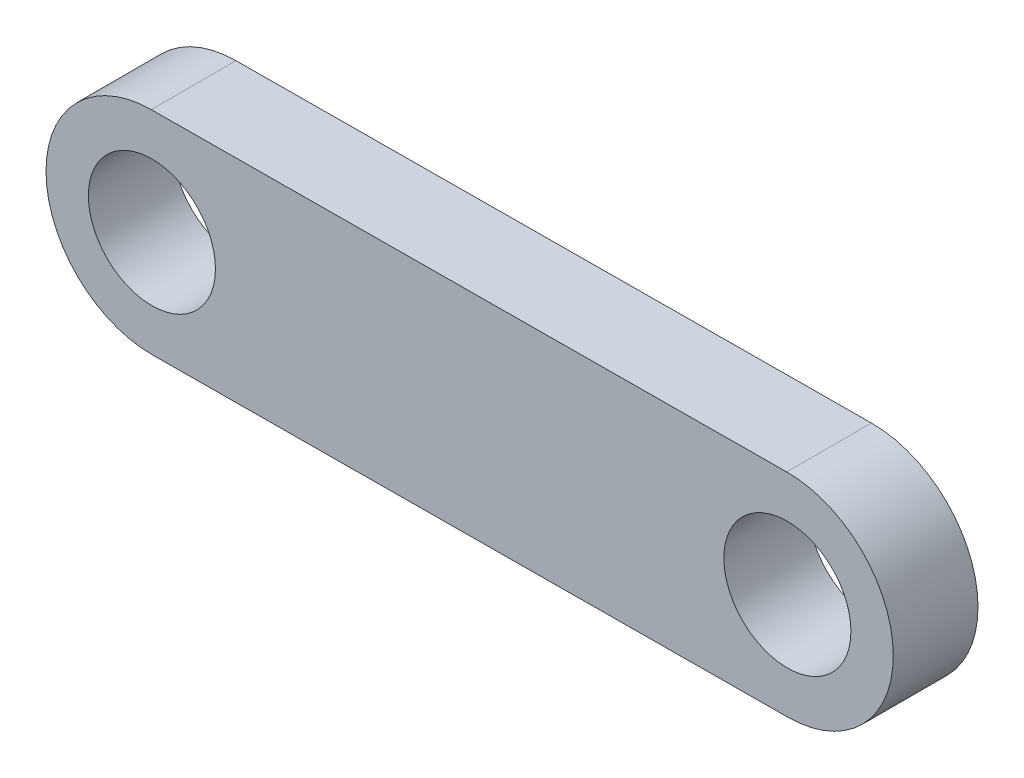
ISO-10303-21;
HEADER;
FILE_DESCRIPTION(('STEP AP214'),'2;1');
FILE_NAME('part.step','',(''),(''),'','','');
FILE_SCHEMA(('AUTOMOTIVE_DESIGN { 1 0 10303 214 1 1 1 1 }'));
ENDSEC;
DATA;
#1=APPLICATION_CONTEXT('core data for automotive mechanical design processes');
#2=APPLICATION_PROTOCOL_DEFINITION('international standard','automotive_design',2000,#1);
#3=PRODUCT_CONTEXT('',#1,'mechanical');
#4=PRODUCT('Part','Part','',(#3));
#5=PRODUCT_RELATED_PRODUCT_CATEGORY('part','',(#4));
#6=PRODUCT_DEFINITION_FORMATION('','',#4);
#7=PRODUCT_DEFINITION_CONTEXT('part definition',#1,'design');
#8=PRODUCT_DEFINITION('design','',#6,#7);
#9=PRODUCT_DEFINITION_SHAPE('','',#8);
#10=(LENGTH_UNIT() NAMED_UNIT(*) SI_UNIT(.MILLI.,.METRE.));
#11=(NAMED_UNIT(*) PLANE_ANGLE_UNIT() SI_UNIT($,.RADIAN.));
#12=(NAMED_UNIT(*) SI_UNIT($,.STERADIAN.) SOLID_ANGLE_UNIT());
#13=UNCERTAINTY_MEASURE_WITH_UNIT(LENGTH_MEASURE(1.E-05),#10,'distance_accuracy_value','');
#14=(GEOMETRIC_REPRESENTATION_CONTEXT(3) GLOBAL_UNCERTAINTY_ASSIGNED_CONTEXT((#13)) GLOBAL_UNIT_ASSIGNED_CONTEXT((#10,
#11,#12)) REPRESENTATION_CONTEXT('',''));
#15=CARTESIAN_POINT('',(0.,0.,0.));
#16=DIRECTION('',(0.,0.,1.));
#17=DIRECTION('',(1.,0.,0.));
#18=AXIS2_PLACEMENT_3D('',#15,#16,#17);
#19=CARTESIAN_POINT('',(0.,0.,2.));
#20=DIRECTION('',(0.,0.,1.));
#21=DIRECTION('',(1.,0.,0.));
#22=AXIS2_PLACEMENT_3D('',#19,#20,#21);
#23=PLANE('',#22);
#24=CARTESIAN_POINT('',(0.,0.,2.));
#25=DIRECTION('',(0.,0.,1.));
#26=DIRECTION('',(1.,0.,0.));
#27=AXIS2_PLACEMENT_3D('',#24,#25,#26);
#28=CIRCLE('',#27,1.5);
#29=CARTESIAN_POINT('',(1.5,0.,2.));
#30=VERTEX_POINT('',#29);
#31=EDGE_CURVE('E103',#30,#30,#28,.T.);
#32=ORIENTED_EDGE('',*,*,#31,.F.);
#33=EDGE_LOOP('',(#32));
#34=FACE_BOUND('',#33,.T.);
#35=CARTESIAN_POINT('',(0.,0.,2.));
#36=DIRECTION('',(0.,0.,1.));
#37=DIRECTION('',(1.,0.,0.));
#38=AXIS2_PLACEMENT_3D('',#35,#36,#37);
#39=CIRCLE('',#38,2.5);
#40=CARTESIAN_POINT('',(-0.015603059271234,2.4999513084341,2.));
#41=VERTEX_POINT('',#40);
#42=CARTESIAN_POINT('',(0.0156030592712317,-2.4999513084341,2.));
#43=VERTEX_POINT('',#42);
#44=EDGE_CURVE('E88',#41,#43,#39,.T.);
#45=ORIENTED_EDGE('',*,*,#44,.T.);
#46=DIRECTION('',(0.999980523373641,0.00624122370849314,0.));
#47=VECTOR('',#46,1.);
#48=CARTESIAN_POINT('',(0.0156030592712317,-2.4999513084341,2.));
#49=LINE('',#48,#47);
#50=CARTESIAN_POINT('',(15.0156030592712,-2.40633112940146,2.));
#51=VERTEX_POINT('',#50);
#52=EDGE_CURVE('E83',#43,#51,#49,.T.);
#53=ORIENTED_EDGE('',*,*,#52,.T.);
#54=CARTESIAN_POINT('',(15.,0.0936201790326438,2.));
#55=DIRECTION('',(0.,0.,1.));
#56=DIRECTION('',(1.,0.,0.));
#57=AXIS2_PLACEMENT_3D('',#54,#55,#56);
#58=CIRCLE('',#57,2.5);
#59=CARTESIAN_POINT('',(14.9843969407288,2.59357148746675,2.));
#60=VERTEX_POINT('',#59);
#61=EDGE_CURVE('E86',#51,#60,#58,.T.);
#62=ORIENTED_EDGE('',*,*,#61,.T.);
#63=DIRECTION('',(-0.999980523373641,-0.00624122370849314,0.));
#64=VECTOR('',#63,1.);
#65=CARTESIAN_POINT('',(-0.015603059271234,2.4999513084341,2.));
#66=LINE('',#65,#64);
#67=EDGE_CURVE('E53',#60,#41,#66,.T.);
#68=ORIENTED_EDGE('',*,*,#67,.T.);
#69=EDGE_LOOP('',(#45,#53,#62,#68));
#70=FACE_BOUND('',#69,.T.);
#71=CARTESIAN_POINT('',(15.,0.0936201790326438,2.));
#72=DIRECTION('',(0.,0.,1.));
#73=DIRECTION('',(1.,0.,0.));
#74=AXIS2_PLACEMENT_3D('',#71,#72,#73);
#75=CIRCLE('',#74,1.5);
#76=CARTESIAN_POINT('',(16.5,0.0936201790326438,2.));
#77=VERTEX_POINT('',#76);
#78=EDGE_CURVE('E118',#77,#77,#75,.T.);
#79=ORIENTED_EDGE('',*,*,#78,.F.);
#80=EDGE_LOOP('',(#79));
#81=FACE_BOUND('',#80,.T.);
#82=ADVANCED_FACE('F36',(#34,#70,#81),#23,.T.);
#83=CARTESIAN_POINT('',(0.,0.,0.));
#84=DIRECTION('',(0.,0.,1.));
#85=DIRECTION('',(1.,0.,0.));
#86=AXIS2_PLACEMENT_3D('',#83,#84,#85);
#87=PLANE('',#86);
#88=CARTESIAN_POINT('',(0.,0.,0.));
#89=DIRECTION('',(0.,0.,1.));
#90=DIRECTION('',(1.,0.,0.));
#91=AXIS2_PLACEMENT_3D('',#88,#89,#90);
#92=CIRCLE('',#91,2.5);
#93=CARTESIAN_POINT('',(-0.015603059271234,2.4999513084341,0.));
#94=VERTEX_POINT('',#93);
#95=CARTESIAN_POINT('',(0.0156030592712317,-2.4999513084341,0.));
#96=VERTEX_POINT('',#95);
#97=EDGE_CURVE('E100',#94,#96,#92,.T.);
#98=ORIENTED_EDGE('',*,*,#97,.F.);
#99=DIRECTION('',(-0.999980523373641,-0.00624122370849314,0.));
#100=VECTOR('',#99,1.);
#101=CARTESIAN_POINT('',(-0.015603059271234,2.4999513084341,0.));
#102=LINE('',#101,#100);
#103=CARTESIAN_POINT('',(14.9843969407288,2.59357148746675,0.));
#104=VERTEX_POINT('',#103);
#105=EDGE_CURVE('E76',#104,#94,#102,.T.);
#106=ORIENTED_EDGE('',*,*,#105,.F.);
#107=CARTESIAN_POINT('',(15.,0.0936201790326438,0.));
#108=DIRECTION('',(0.,0.,1.));
#109=DIRECTION('',(1.,0.,0.));
#110=AXIS2_PLACEMENT_3D('',#107,#108,#109);
#111=CIRCLE('',#110,2.5);
#112=CARTESIAN_POINT('',(15.0156030592712,-2.40633112940146,0.));
#113=VERTEX_POINT('',#112);
#114=EDGE_CURVE('E70',#113,#104,#111,.T.);
#115=ORIENTED_EDGE('',*,*,#114,.F.);
#116=DIRECTION('',(0.999980523373641,0.00624122370849314,0.));
#117=VECTOR('',#116,1.);
#118=CARTESIAN_POINT('',(0.0156030592712317,-2.4999513084341,0.));
#119=LINE('',#118,#117);
#120=EDGE_CURVE('E92',#96,#113,#119,.T.);
#121=ORIENTED_EDGE('',*,*,#120,.F.);
#122=EDGE_LOOP('',(#98,#106,#115,#121));
#123=FACE_BOUND('',#122,.T.);
#124=CARTESIAN_POINT('',(0.,0.,0.));
#125=DIRECTION('',(0.,0.,1.));
#126=DIRECTION('',(1.,0.,0.));
#127=AXIS2_PLACEMENT_3D('',#124,#125,#126);
#128=CIRCLE('',#127,1.5);
#129=CARTESIAN_POINT('',(1.5,0.,0.));
#130=VERTEX_POINT('',#129);
#131=EDGE_CURVE('E115',#130,#130,#128,.T.);
#132=ORIENTED_EDGE('',*,*,#131,.T.);
#133=EDGE_LOOP('',(#132));
#134=FACE_BOUND('',#133,.T.);
#135=CARTESIAN_POINT('',(15.,0.0936201790326438,0.));
#136=DIRECTION('',(0.,0.,1.));
#137=DIRECTION('',(1.,0.,0.));
#138=AXIS2_PLACEMENT_3D('',#135,#136,#137);
#139=CIRCLE('',#138,1.5);
#140=CARTESIAN_POINT('',(16.5,0.0936201790326438,0.));
#141=VERTEX_POINT('',#140);
#142=EDGE_CURVE('E121',#141,#141,#139,.T.);
#143=ORIENTED_EDGE('',*,*,#142,.T.);
#144=EDGE_LOOP('',(#143));
#145=FACE_BOUND('',#144,.T.);
#146=ADVANCED_FACE('F111',(#123,#134,#145),#87,.F.);
#147=CARTESIAN_POINT('',(0.,0.,2.));
#148=DIRECTION('',(0.,0.,-1.));
#149=DIRECTION('',(-1.,0.,0.));
#150=AXIS2_PLACEMENT_3D('',#147,#148,#149);
#151=CYLINDRICAL_SURFACE('',#150,2.5);
#152=ORIENTED_EDGE('',*,*,#97,.T.);
#153=DIRECTION('',(0.,0.,-1.));
#154=VECTOR('',#153,1.);
#155=CARTESIAN_POINT('',(0.0156030592712317,-2.4999513084341,2.));
#156=LINE('',#155,#154);
#157=EDGE_CURVE('E11',#43,#96,#156,.T.);
#158=ORIENTED_EDGE('',*,*,#157,.F.);
#159=ORIENTED_EDGE('',*,*,#44,.F.);
#160=DIRECTION('',(0.,0.,-1.));
#161=VECTOR('',#160,1.);
#162=CARTESIAN_POINT('',(-0.015603059271234,2.4999513084341,2.));
#163=LINE('',#162,#161);
#164=EDGE_CURVE('E96',#41,#94,#163,.T.);
#165=ORIENTED_EDGE('',*,*,#164,.T.);
#166=EDGE_LOOP('',(#152,#158,#159,#165));
#167=FACE_BOUND('',#166,.T.);
#168=ADVANCED_FACE('F38',(#167),#151,.T.);
#169=CARTESIAN_POINT('',(0.0156030592712317,-2.4999513084341,2.));
#170=DIRECTION('',(-0.00624122370849314,0.999980523373641,0.));
#171=DIRECTION('',(-0.999980523373641,-0.00624122370849314,0.));
#172=AXIS2_PLACEMENT_3D('',#169,#170,#171);
#173=PLANE('',#172);
#174=ORIENTED_EDGE('',*,*,#120,.T.);
#175=DIRECTION('',(0.,0.,-1.));
#176=VECTOR('',#175,1.);
#177=CARTESIAN_POINT('',(15.0156030592712,-2.40633112940146,2.));
#178=LINE('',#177,#176);
#179=EDGE_CURVE('E45',#51,#113,#178,.T.);
#180=ORIENTED_EDGE('',*,*,#179,.F.);
#181=ORIENTED_EDGE('',*,*,#52,.F.);
#182=ORIENTED_EDGE('',*,*,#157,.T.);
#183=EDGE_LOOP('',(#174,#180,#181,#182));
#184=FACE_BOUND('',#183,.T.);
#185=ADVANCED_FACE('F91',(#184),#173,.F.);
#186=CARTESIAN_POINT('',(15.,0.0936201790326438,2.));
#187=DIRECTION('',(0.,0.,-1.));
#188=DIRECTION('',(-1.,0.,0.));
#189=AXIS2_PLACEMENT_3D('',#186,#187,#188);
#190=CYLINDRICAL_SURFACE('',#189,2.5);
#191=ORIENTED_EDGE('',*,*,#114,.T.);
#192=DIRECTION('',(0.,0.,-1.));
#193=VECTOR('',#192,1.);
#194=CARTESIAN_POINT('',(14.9843969407288,2.59357148746675,2.));
#195=LINE('',#194,#193);
#196=EDGE_CURVE('E93',#60,#104,#195,.T.);
#197=ORIENTED_EDGE('',*,*,#196,.F.);
#198=ORIENTED_EDGE('',*,*,#61,.F.);
#199=ORIENTED_EDGE('',*,*,#179,.T.);
#200=EDGE_LOOP('',(#191,#197,#198,#199));
#201=FACE_BOUND('',#200,.T.);
#202=ADVANCED_FACE('F94',(#201),#190,.T.);
#203=CARTESIAN_POINT('',(-0.015603059271234,2.4999513084341,2.));
#204=DIRECTION('',(0.00624122370849314,-0.999980523373641,0.));
#205=DIRECTION('',(0.999980523373641,0.00624122370849314,0.));
#206=AXIS2_PLACEMENT_3D('',#203,#204,#205);
#207=PLANE('',#206);
#208=ORIENTED_EDGE('',*,*,#105,.T.);
#209=ORIENTED_EDGE('',*,*,#164,.F.);
#210=ORIENTED_EDGE('',*,*,#67,.F.);
#211=ORIENTED_EDGE('',*,*,#196,.T.);
#212=EDGE_LOOP('',(#208,#209,#210,#211));
#213=FACE_BOUND('',#212,.T.);
#214=ADVANCED_FACE('F108',(#213),#207,.F.);
#215=CARTESIAN_POINT('',(0.,0.,2.));
#216=DIRECTION('',(0.,0.,-1.));
#217=DIRECTION('',(-1.,0.,0.));
#218=AXIS2_PLACEMENT_3D('',#215,#216,#217);
#219=CYLINDRICAL_SURFACE('',#218,1.5);
#220=ORIENTED_EDGE('',*,*,#31,.T.);
#221=EDGE_LOOP('',(#220));
#222=FACE_BOUND('',#221,.T.);
#223=ORIENTED_EDGE('',*,*,#131,.F.);
#224=EDGE_LOOP('',(#223));
#225=FACE_BOUND('',#224,.T.);
#226=ADVANCED_FACE('F138',(#222,#225),#219,.F.);
#227=CARTESIAN_POINT('',(15.,0.0936201790326438,2.));
#228=DIRECTION('',(0.,0.,-1.));
#229=DIRECTION('',(-1.,0.,0.));
#230=AXIS2_PLACEMENT_3D('',#227,#228,#229);
#231=CYLINDRICAL_SURFACE('',#230,1.5);
#232=ORIENTED_EDGE('',*,*,#78,.T.);
#233=EDGE_LOOP('',(#232));
#234=FACE_BOUND('',#233,.T.);
#235=ORIENTED_EDGE('',*,*,#142,.F.);
#236=EDGE_LOOP('',(#235));
#237=FACE_BOUND('',#236,.T.);
#238=ADVANCED_FACE('F127',(#234,#237),#231,.F.);
#239=CLOSED_SHELL('',(#82,#146,#168,#185,#202,#214,#226,#238));
#240=MANIFOLD_SOLID_BREP('B2',#239);
#241=ADVANCED_BREP_SHAPE_REPRESENTATION('',(#18,#240),#14);
#242=SHAPE_DEFINITION_REPRESENTATION(#9,#241);
ENDSEC;
END-ISO-10303-21;
